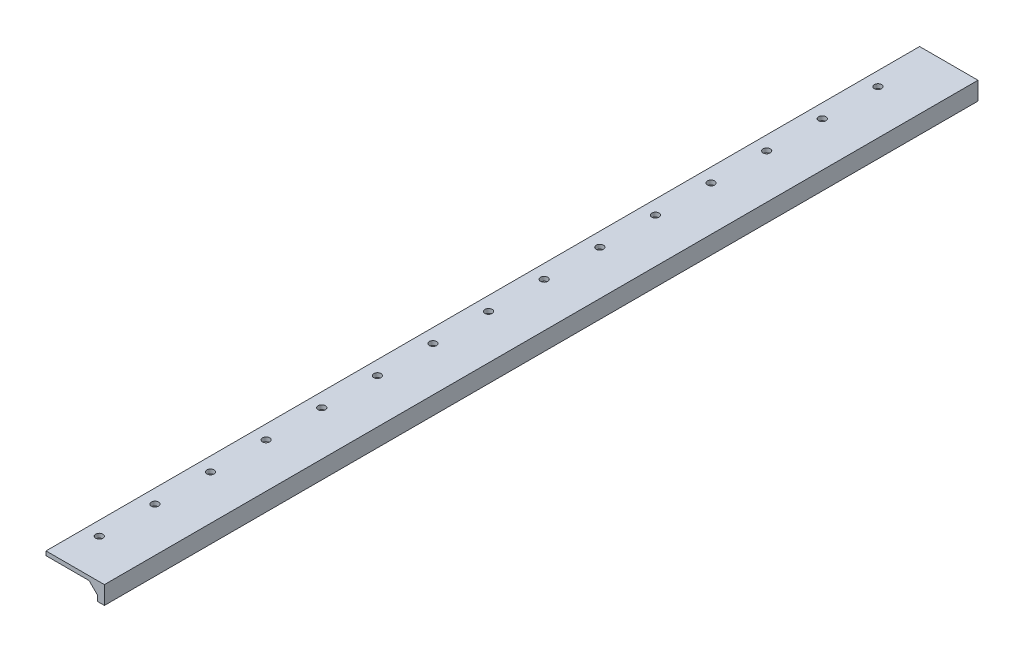
ISO-10303-21;
HEADER;
FILE_DESCRIPTION(('STEP AP214'),'2;1');
FILE_NAME('part.step','',(''),(''),'','','');
FILE_SCHEMA(('AUTOMOTIVE_DESIGN { 1 0 10303 214 1 1 1 1 }'));
ENDSEC;
DATA;
#1=APPLICATION_CONTEXT('core data for automotive mechanical design processes');
#2=APPLICATION_PROTOCOL_DEFINITION('international standard','automotive_design',2000,#1);
#3=PRODUCT_CONTEXT('',#1,'mechanical');
#4=PRODUCT('Part','Part','',(#3));
#5=PRODUCT_RELATED_PRODUCT_CATEGORY('part','',(#4));
#6=PRODUCT_DEFINITION_FORMATION('','',#4);
#7=PRODUCT_DEFINITION_CONTEXT('part definition',#1,'design');
#8=PRODUCT_DEFINITION('design','',#6,#7);
#9=PRODUCT_DEFINITION_SHAPE('','',#8);
#10=(LENGTH_UNIT() NAMED_UNIT(*) SI_UNIT(.MILLI.,.METRE.));
#11=(NAMED_UNIT(*) PLANE_ANGLE_UNIT() SI_UNIT($,.RADIAN.));
#12=(NAMED_UNIT(*) SI_UNIT($,.STERADIAN.) SOLID_ANGLE_UNIT());
#13=UNCERTAINTY_MEASURE_WITH_UNIT(LENGTH_MEASURE(1.E-05),#10,'distance_accuracy_value','');
#14=(GEOMETRIC_REPRESENTATION_CONTEXT(3) GLOBAL_UNCERTAINTY_ASSIGNED_CONTEXT((#13)) GLOBAL_UNIT_ASSIGNED_CONTEXT((#10,
#11,#12)) REPRESENTATION_CONTEXT('',''));
#15=CARTESIAN_POINT('',(0.,0.,0.));
#16=DIRECTION('',(0.,0.,1.));
#17=DIRECTION('',(1.,0.,0.));
#18=AXIS2_PLACEMENT_3D('',#15,#16,#17);
#19=CARTESIAN_POINT('',(-37.,3.,0.));
#20=DIRECTION('',(1.,0.,0.));
#21=DIRECTION('',(0.,0.,-1.));
#22=AXIS2_PLACEMENT_3D('',#19,#20,#21);
#23=PLANE('',#22);
#24=DIRECTION('',(0.,0.,1.));
#25=VECTOR('',#24,1.);
#26=CARTESIAN_POINT('',(-37.,0.,0.));
#27=LINE('',#26,#25);
#28=CARTESIAN_POINT('',(-37.,0.,0.));
#29=VERTEX_POINT('',#28);
#30=CARTESIAN_POINT('',(-36.9999999999999,0.,628.32));
#31=VERTEX_POINT('',#30);
#32=EDGE_CURVE('E73',#29,#31,#27,.T.);
#33=ORIENTED_EDGE('',*,*,#32,.T.);
#34=DIRECTION('',(0.,-1.,0.));
#35=VECTOR('',#34,1.);
#36=CARTESIAN_POINT('',(-36.9999999999999,3.,628.32));
#37=LINE('',#36,#35);
#38=CARTESIAN_POINT('',(-36.9999999999999,3.,628.32));
#39=VERTEX_POINT('',#38);
#40=EDGE_CURVE('E11',#39,#31,#37,.T.);
#41=ORIENTED_EDGE('',*,*,#40,.F.);
#42=DIRECTION('',(0.,0.,1.));
#43=VECTOR('',#42,1.);
#44=CARTESIAN_POINT('',(-37.,3.,0.));
#45=LINE('',#44,#43);
#46=CARTESIAN_POINT('',(-37.,3.,0.));
#47=VERTEX_POINT('',#46);
#48=EDGE_CURVE('E75',#47,#39,#45,.T.);
#49=ORIENTED_EDGE('',*,*,#48,.F.);
#50=DIRECTION('',(0.,-1.,0.));
#51=VECTOR('',#50,1.);
#52=CARTESIAN_POINT('',(-37.,3.,0.));
#53=LINE('',#52,#51);
#54=EDGE_CURVE('E44',#47,#29,#53,.T.);
#55=ORIENTED_EDGE('',*,*,#54,.T.);
#56=EDGE_LOOP('',(#33,#41,#49,#55));
#57=FACE_BOUND('',#56,.T.);
#58=ADVANCED_FACE('F37',(#57),#23,.F.);
#59=CARTESIAN_POINT('',(-36.9999999999999,3.,628.32));
#60=DIRECTION('',(0.,0.,-1.));
#61=DIRECTION('',(-1.,0.,0.));
#62=AXIS2_PLACEMENT_3D('',#59,#60,#61);
#63=PLANE('',#62);
#64=DIRECTION('',(1.,0.,0.));
#65=VECTOR('',#64,1.);
#66=CARTESIAN_POINT('',(-36.9999999999999,0.,628.32));
#67=LINE('',#66,#65);
#68=CARTESIAN_POINT('',(-6.,0.,628.32));
#69=VERTEX_POINT('',#68);
#70=EDGE_CURVE('E84',#31,#69,#67,.T.);
#71=ORIENTED_EDGE('',*,*,#70,.T.);
#72=DIRECTION('',(0.707106781186552,-0.707106781186543,0.));
#73=VECTOR('',#72,1.);
#74=CARTESIAN_POINT('',(0.,-6.,628.32));
#75=LINE('',#74,#73);
#76=CARTESIAN_POINT('',(0.,-6.,628.32));
#77=VERTEX_POINT('',#76);
#78=EDGE_CURVE('E51',#69,#77,#75,.T.);
#79=ORIENTED_EDGE('',*,*,#78,.T.);
#80=DIRECTION('',(0.,-1.,0.));
#81=VECTOR('',#80,1.);
#82=CARTESIAN_POINT('',(0.,3.,628.32));
#83=LINE('',#82,#81);
#84=CARTESIAN_POINT('',(0.,-10.,628.32));
#85=VERTEX_POINT('',#84);
#86=EDGE_CURVE('E85',#77,#85,#83,.T.);
#87=ORIENTED_EDGE('',*,*,#86,.T.);
#88=DIRECTION('',(-1.,0.,0.));
#89=VECTOR('',#88,1.);
#90=CARTESIAN_POINT('',(0.,-10.,628.32));
#91=LINE('',#90,#89);
#92=CARTESIAN_POINT('',(5.,-10.,628.32));
#93=VERTEX_POINT('',#92);
#94=EDGE_CURVE('E113',#93,#85,#91,.T.);
#95=ORIENTED_EDGE('',*,*,#94,.F.);
#96=DIRECTION('',(0.,-1.,0.));
#97=VECTOR('',#96,1.);
#98=CARTESIAN_POINT('',(5.,3.,628.32));
#99=LINE('',#98,#97);
#100=CARTESIAN_POINT('',(5.,3.,628.32));
#101=VERTEX_POINT('',#100);
#102=EDGE_CURVE('E107',#101,#93,#99,.T.);
#103=ORIENTED_EDGE('',*,*,#102,.F.);
#104=DIRECTION('',(1.,0.,0.));
#105=VECTOR('',#104,1.);
#106=CARTESIAN_POINT('',(-36.9999999999999,3.,628.32));
#107=LINE('',#106,#105);
#108=EDGE_CURVE('E93',#39,#101,#107,.T.);
#109=ORIENTED_EDGE('',*,*,#108,.F.);
#110=ORIENTED_EDGE('',*,*,#40,.T.);
#111=EDGE_LOOP('',(#71,#79,#87,#95,#103,#109,#110));
#112=FACE_BOUND('',#111,.T.);
#113=ADVANCED_FACE('F250',(#112),#63,.F.);
#114=CARTESIAN_POINT('',(-37.,3.,0.));
#115=DIRECTION('',(0.,0.,-1.));
#116=DIRECTION('',(-1.,0.,0.));
#117=AXIS2_PLACEMENT_3D('',#114,#115,#116);
#118=PLANE('',#117);
#119=DIRECTION('',(0.707106781186552,-0.707106781186543,0.));
#120=VECTOR('',#119,1.);
#121=CARTESIAN_POINT('',(0.,-6.,0.));
#122=LINE('',#121,#120);
#123=CARTESIAN_POINT('',(-6.,0.,0.));
#124=VERTEX_POINT('',#123);
#125=CARTESIAN_POINT('',(0.,-6.,0.));
#126=VERTEX_POINT('',#125);
#127=EDGE_CURVE('E91',#124,#126,#122,.T.);
#128=ORIENTED_EDGE('',*,*,#127,.F.);
#129=DIRECTION('',(1.,0.,0.));
#130=VECTOR('',#129,1.);
#131=CARTESIAN_POINT('',(-37.,0.,0.));
#132=LINE('',#131,#130);
#133=EDGE_CURVE('E83',#29,#124,#132,.T.);
#134=ORIENTED_EDGE('',*,*,#133,.F.);
#135=ORIENTED_EDGE('',*,*,#54,.F.);
#136=DIRECTION('',(1.,0.,0.));
#137=VECTOR('',#136,1.);
#138=CARTESIAN_POINT('',(-37.,3.,0.));
#139=LINE('',#138,#137);
#140=CARTESIAN_POINT('',(5.,3.,0.));
#141=VERTEX_POINT('',#140);
#142=EDGE_CURVE('E77',#47,#141,#139,.T.);
#143=ORIENTED_EDGE('',*,*,#142,.T.);
#144=DIRECTION('',(0.,-1.,0.));
#145=VECTOR('',#144,1.);
#146=CARTESIAN_POINT('',(5.,3.,0.));
#147=LINE('',#146,#145);
#148=CARTESIAN_POINT('',(5.,-10.,0.));
#149=VERTEX_POINT('',#148);
#150=EDGE_CURVE('E103',#141,#149,#147,.T.);
#151=ORIENTED_EDGE('',*,*,#150,.T.);
#152=DIRECTION('',(1.,0.,0.));
#153=VECTOR('',#152,1.);
#154=CARTESIAN_POINT('',(0.,-10.,0.));
#155=LINE('',#154,#153);
#156=CARTESIAN_POINT('',(0.,-10.,0.));
#157=VERTEX_POINT('',#156);
#158=EDGE_CURVE('E119',#157,#149,#155,.T.);
#159=ORIENTED_EDGE('',*,*,#158,.F.);
#160=DIRECTION('',(0.,-1.,0.));
#161=VECTOR('',#160,1.);
#162=CARTESIAN_POINT('',(0.,3.,0.));
#163=LINE('',#162,#161);
#164=EDGE_CURVE('E100',#126,#157,#163,.T.);
#165=ORIENTED_EDGE('',*,*,#164,.F.);
#166=EDGE_LOOP('',(#128,#134,#135,#143,#151,#159,#165));
#167=FACE_BOUND('',#166,.T.);
#168=ADVANCED_FACE('F88',(#167),#118,.T.);
#169=CARTESIAN_POINT('',(0.,3.,0.));
#170=DIRECTION('',(0.,1.,0.));
#171=DIRECTION('',(0.,0.,1.));
#172=AXIS2_PLACEMENT_3D('',#169,#170,#171);
#173=PLANE('',#172);
#174=CARTESIAN_POINT('',(-27.,3.,40.));
#175=DIRECTION('',(0.,1.,0.));
#176=DIRECTION('',(0.,0.,1.));
#177=AXIS2_PLACEMENT_3D('',#174,#175,#176);
#178=CIRCLE('',#177,2.6);
#179=CARTESIAN_POINT('',(-27.,3.,42.6));
#180=VERTEX_POINT('',#179);
#181=EDGE_CURVE('E125',#180,#180,#178,.T.);
#182=ORIENTED_EDGE('',*,*,#181,.F.);
#183=EDGE_LOOP('',(#182));
#184=FACE_BOUND('',#183,.T.);
#185=CARTESIAN_POINT('',(-27.0000000000001,3.,80.));
#186=DIRECTION('',(0.,1.,0.));
#187=DIRECTION('',(0.,0.,1.));
#188=AXIS2_PLACEMENT_3D('',#185,#186,#187);
#189=CIRCLE('',#188,2.6);
#190=CARTESIAN_POINT('',(-27.0000000000001,3.,82.6));
#191=VERTEX_POINT('',#190);
#192=EDGE_CURVE('E128',#191,#191,#189,.T.);
#193=ORIENTED_EDGE('',*,*,#192,.F.);
#194=EDGE_LOOP('',(#193));
#195=FACE_BOUND('',#194,.T.);
#196=CARTESIAN_POINT('',(-27.0000000000003,3.,120.));
#197=DIRECTION('',(0.,1.,0.));
#198=DIRECTION('',(0.,0.,1.));
#199=AXIS2_PLACEMENT_3D('',#196,#197,#198);
#200=CIRCLE('',#199,2.6);
#201=CARTESIAN_POINT('',(-27.0000000000003,3.,122.6));
#202=VERTEX_POINT('',#201);
#203=EDGE_CURVE('E131',#202,#202,#200,.T.);
#204=ORIENTED_EDGE('',*,*,#203,.F.);
#205=EDGE_LOOP('',(#204));
#206=FACE_BOUND('',#205,.T.);
#207=CARTESIAN_POINT('',(-27.0000000000004,3.,160.));
#208=DIRECTION('',(0.,1.,0.));
#209=DIRECTION('',(0.,0.,1.));
#210=AXIS2_PLACEMENT_3D('',#207,#208,#209);
#211=CIRCLE('',#210,2.6);
#212=CARTESIAN_POINT('',(-27.0000000000004,3.,162.6));
#213=VERTEX_POINT('',#212);
#214=EDGE_CURVE('E134',#213,#213,#211,.T.);
#215=ORIENTED_EDGE('',*,*,#214,.F.);
#216=EDGE_LOOP('',(#215));
#217=FACE_BOUND('',#216,.T.);
#218=CARTESIAN_POINT('',(-27.0000000000006,3.,200.));
#219=DIRECTION('',(0.,1.,0.));
#220=DIRECTION('',(0.,0.,1.));
#221=AXIS2_PLACEMENT_3D('',#218,#219,#220);
#222=CIRCLE('',#221,2.6);
#223=CARTESIAN_POINT('',(-27.0000000000006,3.,202.6));
#224=VERTEX_POINT('',#223);
#225=EDGE_CURVE('E137',#224,#224,#222,.T.);
#226=ORIENTED_EDGE('',*,*,#225,.F.);
#227=EDGE_LOOP('',(#226));
#228=FACE_BOUND('',#227,.T.);
#229=CARTESIAN_POINT('',(-27.0000000000007,3.,240.));
#230=DIRECTION('',(0.,1.,0.));
#231=DIRECTION('',(0.,0.,1.));
#232=AXIS2_PLACEMENT_3D('',#229,#230,#231);
#233=CIRCLE('',#232,2.6);
#234=CARTESIAN_POINT('',(-27.0000000000007,3.,242.6));
#235=VERTEX_POINT('',#234);
#236=EDGE_CURVE('E140',#235,#235,#233,.T.);
#237=ORIENTED_EDGE('',*,*,#236,.F.);
#238=EDGE_LOOP('',(#237));
#239=FACE_BOUND('',#238,.T.);
#240=CARTESIAN_POINT('',(-27.0000000000008,3.,280.));
#241=DIRECTION('',(0.,1.,0.));
#242=DIRECTION('',(0.,0.,1.));
#243=AXIS2_PLACEMENT_3D('',#240,#241,#242);
#244=CIRCLE('',#243,2.6);
#245=CARTESIAN_POINT('',(-27.0000000000008,3.,282.6));
#246=VERTEX_POINT('',#245);
#247=EDGE_CURVE('E143',#246,#246,#244,.T.);
#248=ORIENTED_EDGE('',*,*,#247,.F.);
#249=EDGE_LOOP('',(#248));
#250=FACE_BOUND('',#249,.T.);
#251=CARTESIAN_POINT('',(-27.000000000001,3.,320.));
#252=DIRECTION('',(0.,1.,0.));
#253=DIRECTION('',(0.,0.,1.));
#254=AXIS2_PLACEMENT_3D('',#251,#252,#253);
#255=CIRCLE('',#254,2.6);
#256=CARTESIAN_POINT('',(-27.000000000001,3.,322.6));
#257=VERTEX_POINT('',#256);
#258=EDGE_CURVE('E146',#257,#257,#255,.T.);
#259=ORIENTED_EDGE('',*,*,#258,.F.);
#260=EDGE_LOOP('',(#259));
#261=FACE_BOUND('',#260,.T.);
#262=CARTESIAN_POINT('',(-27.0000000000011,3.,360.));
#263=DIRECTION('',(0.,1.,0.));
#264=DIRECTION('',(0.,0.,1.));
#265=AXIS2_PLACEMENT_3D('',#262,#263,#264);
#266=CIRCLE('',#265,2.60000000000001);
#267=CARTESIAN_POINT('',(-27.0000000000011,3.,362.6));
#268=VERTEX_POINT('',#267);
#269=EDGE_CURVE('E149',#268,#268,#266,.T.);
#270=ORIENTED_EDGE('',*,*,#269,.F.);
#271=EDGE_LOOP('',(#270));
#272=FACE_BOUND('',#271,.T.);
#273=CARTESIAN_POINT('',(-27.0000000000012,3.,400.));
#274=DIRECTION('',(0.,1.,0.));
#275=DIRECTION('',(0.,0.,1.));
#276=AXIS2_PLACEMENT_3D('',#273,#274,#275);
#277=CIRCLE('',#276,2.6);
#278=CARTESIAN_POINT('',(-27.0000000000012,3.,402.6));
#279=VERTEX_POINT('',#278);
#280=EDGE_CURVE('E152',#279,#279,#277,.T.);
#281=ORIENTED_EDGE('',*,*,#280,.F.);
#282=EDGE_LOOP('',(#281));
#283=FACE_BOUND('',#282,.T.);
#284=CARTESIAN_POINT('',(-27.0000000000014,3.,440.));
#285=DIRECTION('',(0.,1.,0.));
#286=DIRECTION('',(0.,0.,1.));
#287=AXIS2_PLACEMENT_3D('',#284,#285,#286);
#288=CIRCLE('',#287,2.6);
#289=CARTESIAN_POINT('',(-27.0000000000014,3.,442.6));
#290=VERTEX_POINT('',#289);
#291=EDGE_CURVE('E155',#290,#290,#288,.T.);
#292=ORIENTED_EDGE('',*,*,#291,.F.);
#293=EDGE_LOOP('',(#292));
#294=FACE_BOUND('',#293,.T.);
#295=CARTESIAN_POINT('',(-27.0000000000015,3.,480.));
#296=DIRECTION('',(0.,1.,0.));
#297=DIRECTION('',(0.,0.,1.));
#298=AXIS2_PLACEMENT_3D('',#295,#296,#297);
#299=CIRCLE('',#298,2.60000000000001);
#300=CARTESIAN_POINT('',(-27.0000000000015,3.,482.6));
#301=VERTEX_POINT('',#300);
#302=EDGE_CURVE('E158',#301,#301,#299,.T.);
#303=ORIENTED_EDGE('',*,*,#302,.F.);
#304=EDGE_LOOP('',(#303));
#305=FACE_BOUND('',#304,.T.);
#306=CARTESIAN_POINT('',(-27.0000000000017,3.,520.));
#307=DIRECTION('',(0.,1.,0.));
#308=DIRECTION('',(0.,0.,1.));
#309=AXIS2_PLACEMENT_3D('',#306,#307,#308);
#310=CIRCLE('',#309,2.59999999999998);
#311=CARTESIAN_POINT('',(-27.0000000000017,3.,522.6));
#312=VERTEX_POINT('',#311);
#313=EDGE_CURVE('E161',#312,#312,#310,.T.);
#314=ORIENTED_EDGE('',*,*,#313,.F.);
#315=EDGE_LOOP('',(#314));
#316=FACE_BOUND('',#315,.T.);
#317=CARTESIAN_POINT('',(-27.0000000000018,3.,560.));
#318=DIRECTION('',(0.,1.,0.));
#319=DIRECTION('',(0.,0.,1.));
#320=AXIS2_PLACEMENT_3D('',#317,#318,#319);
#321=CIRCLE('',#320,2.59999999999998);
#322=CARTESIAN_POINT('',(-27.0000000000018,3.,562.6));
#323=VERTEX_POINT('',#322);
#324=EDGE_CURVE('E164',#323,#323,#321,.T.);
#325=ORIENTED_EDGE('',*,*,#324,.F.);
#326=EDGE_LOOP('',(#325));
#327=FACE_BOUND('',#326,.T.);
#328=CARTESIAN_POINT('',(-27.0000000000019,3.,600.));
#329=DIRECTION('',(0.,1.,0.));
#330=DIRECTION('',(0.,0.,1.));
#331=AXIS2_PLACEMENT_3D('',#328,#329,#330);
#332=CIRCLE('',#331,2.59999999999998);
#333=CARTESIAN_POINT('',(-27.0000000000019,3.,602.6));
#334=VERTEX_POINT('',#333);
#335=EDGE_CURVE('E167',#334,#334,#332,.T.);
#336=ORIENTED_EDGE('',*,*,#335,.F.);
#337=EDGE_LOOP('',(#336));
#338=FACE_BOUND('',#337,.T.);
#339=ORIENTED_EDGE('',*,*,#48,.T.);
#340=ORIENTED_EDGE('',*,*,#108,.T.);
#341=DIRECTION('',(0.,0.,1.));
#342=VECTOR('',#341,1.);
#343=CARTESIAN_POINT('',(5.,3.,0.));
#344=LINE('',#343,#342);
#345=EDGE_CURVE('E104',#141,#101,#344,.T.);
#346=ORIENTED_EDGE('',*,*,#345,.F.);
#347=ORIENTED_EDGE('',*,*,#142,.F.);
#348=EDGE_LOOP('',(#339,#340,#346,#347));
#349=FACE_BOUND('',#348,.T.);
#350=ADVANCED_FACE('F249',(#184,#195,#206,#217,#228,#239,#250,#261,#272,#283,#294,#305,#316,
#327,#338,#349),#173,.T.);
#351=CARTESIAN_POINT('',(0.,0.,0.));
#352=DIRECTION('',(0.,1.,0.));
#353=DIRECTION('',(0.,0.,1.));
#354=AXIS2_PLACEMENT_3D('',#351,#352,#353);
#355=PLANE('',#354);
#356=CARTESIAN_POINT('',(-27.,0.,40.));
#357=DIRECTION('',(0.,-1.,0.));
#358=DIRECTION('',(0.,0.,-1.));
#359=AXIS2_PLACEMENT_3D('',#356,#357,#358);
#360=CIRCLE('',#359,2.6);
#361=CARTESIAN_POINT('',(-27.,0.,37.4));
#362=VERTEX_POINT('',#361);
#363=EDGE_CURVE('E170',#362,#362,#360,.T.);
#364=ORIENTED_EDGE('',*,*,#363,.F.);
#365=EDGE_LOOP('',(#364));
#366=FACE_BOUND('',#365,.T.);
#367=CARTESIAN_POINT('',(-27.0000000000001,0.,80.));
#368=DIRECTION('',(0.,-1.,0.));
#369=DIRECTION('',(0.,0.,-1.));
#370=AXIS2_PLACEMENT_3D('',#367,#368,#369);
#371=CIRCLE('',#370,2.6);
#372=CARTESIAN_POINT('',(-27.0000000000001,0.,77.4));
#373=VERTEX_POINT('',#372);
#374=EDGE_CURVE('E211',#373,#373,#371,.T.);
#375=ORIENTED_EDGE('',*,*,#374,.F.);
#376=EDGE_LOOP('',(#375));
#377=FACE_BOUND('',#376,.T.);
#378=CARTESIAN_POINT('',(-27.0000000000003,0.,120.));
#379=DIRECTION('',(0.,-1.,0.));
#380=DIRECTION('',(0.,0.,-1.));
#381=AXIS2_PLACEMENT_3D('',#378,#379,#380);
#382=CIRCLE('',#381,2.6);
#383=CARTESIAN_POINT('',(-27.0000000000003,0.,117.4));
#384=VERTEX_POINT('',#383);
#385=EDGE_CURVE('E208',#384,#384,#382,.T.);
#386=ORIENTED_EDGE('',*,*,#385,.F.);
#387=EDGE_LOOP('',(#386));
#388=FACE_BOUND('',#387,.T.);
#389=CARTESIAN_POINT('',(-27.0000000000004,0.,160.));
#390=DIRECTION('',(0.,-1.,0.));
#391=DIRECTION('',(0.,0.,-1.));
#392=AXIS2_PLACEMENT_3D('',#389,#390,#391);
#393=CIRCLE('',#392,2.6);
#394=CARTESIAN_POINT('',(-27.0000000000004,0.,157.4));
#395=VERTEX_POINT('',#394);
#396=EDGE_CURVE('E205',#395,#395,#393,.T.);
#397=ORIENTED_EDGE('',*,*,#396,.F.);
#398=EDGE_LOOP('',(#397));
#399=FACE_BOUND('',#398,.T.);
#400=CARTESIAN_POINT('',(-27.0000000000006,0.,200.));
#401=DIRECTION('',(0.,-1.,0.));
#402=DIRECTION('',(0.,0.,-1.));
#403=AXIS2_PLACEMENT_3D('',#400,#401,#402);
#404=CIRCLE('',#403,2.6);
#405=CARTESIAN_POINT('',(-27.0000000000006,0.,197.4));
#406=VERTEX_POINT('',#405);
#407=EDGE_CURVE('E202',#406,#406,#404,.T.);
#408=ORIENTED_EDGE('',*,*,#407,.F.);
#409=EDGE_LOOP('',(#408));
#410=FACE_BOUND('',#409,.T.);
#411=CARTESIAN_POINT('',(-27.0000000000007,0.,240.));
#412=DIRECTION('',(0.,-1.,0.));
#413=DIRECTION('',(0.,0.,-1.));
#414=AXIS2_PLACEMENT_3D('',#411,#412,#413);
#415=CIRCLE('',#414,2.6);
#416=CARTESIAN_POINT('',(-27.0000000000007,0.,237.4));
#417=VERTEX_POINT('',#416);
#418=EDGE_CURVE('E199',#417,#417,#415,.T.);
#419=ORIENTED_EDGE('',*,*,#418,.F.);
#420=EDGE_LOOP('',(#419));
#421=FACE_BOUND('',#420,.T.);
#422=CARTESIAN_POINT('',(-27.0000000000008,0.,280.));
#423=DIRECTION('',(0.,-1.,0.));
#424=DIRECTION('',(0.,0.,-1.));
#425=AXIS2_PLACEMENT_3D('',#422,#423,#424);
#426=CIRCLE('',#425,2.6);
#427=CARTESIAN_POINT('',(-27.0000000000008,0.,277.4));
#428=VERTEX_POINT('',#427);
#429=EDGE_CURVE('E196',#428,#428,#426,.T.);
#430=ORIENTED_EDGE('',*,*,#429,.F.);
#431=EDGE_LOOP('',(#430));
#432=FACE_BOUND('',#431,.T.);
#433=CARTESIAN_POINT('',(-27.000000000001,0.,320.));
#434=DIRECTION('',(0.,-1.,0.));
#435=DIRECTION('',(0.,0.,-1.));
#436=AXIS2_PLACEMENT_3D('',#433,#434,#435);
#437=CIRCLE('',#436,2.6);
#438=CARTESIAN_POINT('',(-27.000000000001,0.,317.4));
#439=VERTEX_POINT('',#438);
#440=EDGE_CURVE('E193',#439,#439,#437,.T.);
#441=ORIENTED_EDGE('',*,*,#440,.F.);
#442=EDGE_LOOP('',(#441));
#443=FACE_BOUND('',#442,.T.);
#444=CARTESIAN_POINT('',(-27.0000000000011,0.,360.));
#445=DIRECTION('',(0.,-1.,0.));
#446=DIRECTION('',(0.,0.,-1.));
#447=AXIS2_PLACEMENT_3D('',#444,#445,#446);
#448=CIRCLE('',#447,2.60000000000001);
#449=CARTESIAN_POINT('',(-27.0000000000011,0.,357.4));
#450=VERTEX_POINT('',#449);
#451=EDGE_CURVE('E190',#450,#450,#448,.T.);
#452=ORIENTED_EDGE('',*,*,#451,.F.);
#453=EDGE_LOOP('',(#452));
#454=FACE_BOUND('',#453,.T.);
#455=CARTESIAN_POINT('',(-27.0000000000012,0.,400.));
#456=DIRECTION('',(0.,-1.,0.));
#457=DIRECTION('',(0.,0.,-1.));
#458=AXIS2_PLACEMENT_3D('',#455,#456,#457);
#459=CIRCLE('',#458,2.6);
#460=CARTESIAN_POINT('',(-27.0000000000012,0.,397.4));
#461=VERTEX_POINT('',#460);
#462=EDGE_CURVE('E187',#461,#461,#459,.T.);
#463=ORIENTED_EDGE('',*,*,#462,.F.);
#464=EDGE_LOOP('',(#463));
#465=FACE_BOUND('',#464,.T.);
#466=CARTESIAN_POINT('',(-27.0000000000014,0.,440.));
#467=DIRECTION('',(0.,-1.,0.));
#468=DIRECTION('',(0.,0.,-1.));
#469=AXIS2_PLACEMENT_3D('',#466,#467,#468);
#470=CIRCLE('',#469,2.6);
#471=CARTESIAN_POINT('',(-27.0000000000014,0.,437.4));
#472=VERTEX_POINT('',#471);
#473=EDGE_CURVE('E184',#472,#472,#470,.T.);
#474=ORIENTED_EDGE('',*,*,#473,.F.);
#475=EDGE_LOOP('',(#474));
#476=FACE_BOUND('',#475,.T.);
#477=CARTESIAN_POINT('',(-27.0000000000015,0.,480.));
#478=DIRECTION('',(0.,-1.,0.));
#479=DIRECTION('',(0.,0.,-1.));
#480=AXIS2_PLACEMENT_3D('',#477,#478,#479);
#481=CIRCLE('',#480,2.60000000000001);
#482=CARTESIAN_POINT('',(-27.0000000000015,0.,477.4));
#483=VERTEX_POINT('',#482);
#484=EDGE_CURVE('E181',#483,#483,#481,.T.);
#485=ORIENTED_EDGE('',*,*,#484,.F.);
#486=EDGE_LOOP('',(#485));
#487=FACE_BOUND('',#486,.T.);
#488=CARTESIAN_POINT('',(-27.0000000000017,0.,520.));
#489=DIRECTION('',(0.,-1.,0.));
#490=DIRECTION('',(0.,0.,-1.));
#491=AXIS2_PLACEMENT_3D('',#488,#489,#490);
#492=CIRCLE('',#491,2.59999999999998);
#493=CARTESIAN_POINT('',(-27.0000000000017,0.,517.4));
#494=VERTEX_POINT('',#493);
#495=EDGE_CURVE('E178',#494,#494,#492,.T.);
#496=ORIENTED_EDGE('',*,*,#495,.F.);
#497=EDGE_LOOP('',(#496));
#498=FACE_BOUND('',#497,.T.);
#499=CARTESIAN_POINT('',(-27.0000000000018,0.,560.));
#500=DIRECTION('',(0.,-1.,0.));
#501=DIRECTION('',(0.,0.,-1.));
#502=AXIS2_PLACEMENT_3D('',#499,#500,#501);
#503=CIRCLE('',#502,2.59999999999998);
#504=CARTESIAN_POINT('',(-27.0000000000018,0.,557.4));
#505=VERTEX_POINT('',#504);
#506=EDGE_CURVE('E174',#505,#505,#503,.T.);
#507=ORIENTED_EDGE('',*,*,#506,.F.);
#508=EDGE_LOOP('',(#507));
#509=FACE_BOUND('',#508,.T.);
#510=CARTESIAN_POINT('',(-27.0000000000019,0.,600.));
#511=DIRECTION('',(0.,-1.,0.));
#512=DIRECTION('',(0.,0.,-1.));
#513=AXIS2_PLACEMENT_3D('',#510,#511,#512);
#514=CIRCLE('',#513,2.59999999999998);
#515=CARTESIAN_POINT('',(-27.0000000000019,0.,597.4));
#516=VERTEX_POINT('',#515);
#517=EDGE_CURVE('E171',#516,#516,#514,.T.);
#518=ORIENTED_EDGE('',*,*,#517,.F.);
#519=EDGE_LOOP('',(#518));
#520=FACE_BOUND('',#519,.T.);
#521=ORIENTED_EDGE('',*,*,#133,.T.);
#522=DIRECTION('',(0.,0.,1.));
#523=VECTOR('',#522,1.);
#524=CARTESIAN_POINT('',(-6.,0.,0.));
#525=LINE('',#524,#523);
#526=EDGE_CURVE('E216',#124,#69,#525,.T.);
#527=ORIENTED_EDGE('',*,*,#526,.T.);
#528=ORIENTED_EDGE('',*,*,#70,.F.);
#529=ORIENTED_EDGE('',*,*,#32,.F.);
#530=EDGE_LOOP('',(#521,#527,#528,#529));
#531=FACE_BOUND('',#530,.T.);
#532=ADVANCED_FACE('F80',(#366,#377,#388,#399,#410,#421,#432,#443,#454,#465,#476,#487,#498,#509,
#520,#531),#355,.F.);
#533=CARTESIAN_POINT('',(0.,3.,0.));
#534=DIRECTION('',(-1.,0.,0.));
#535=DIRECTION('',(0.,0.,1.));
#536=AXIS2_PLACEMENT_3D('',#533,#534,#535);
#537=PLANE('',#536);
#538=DIRECTION('',(0.,0.,1.));
#539=VECTOR('',#538,1.);
#540=CARTESIAN_POINT('',(0.,-6.,0.));
#541=LINE('',#540,#539);
#542=EDGE_CURVE('E175',#126,#77,#541,.T.);
#543=ORIENTED_EDGE('',*,*,#542,.F.);
#544=ORIENTED_EDGE('',*,*,#164,.T.);
#545=DIRECTION('',(0.,0.,-1.));
#546=VECTOR('',#545,1.);
#547=CARTESIAN_POINT('',(0.,-10.,0.));
#548=LINE('',#547,#546);
#549=EDGE_CURVE('E122',#85,#157,#548,.T.);
#550=ORIENTED_EDGE('',*,*,#549,.F.);
#551=ORIENTED_EDGE('',*,*,#86,.F.);
#552=EDGE_LOOP('',(#543,#544,#550,#551));
#553=FACE_BOUND('',#552,.T.);
#554=ADVANCED_FACE('F229',(#553),#537,.T.);
#555=CARTESIAN_POINT('',(5.,3.,0.));
#556=DIRECTION('',(1.,0.,0.));
#557=DIRECTION('',(0.,0.,-1.));
#558=AXIS2_PLACEMENT_3D('',#555,#556,#557);
#559=PLANE('',#558);
#560=ORIENTED_EDGE('',*,*,#102,.T.);
#561=DIRECTION('',(0.,0.,1.));
#562=VECTOR('',#561,1.);
#563=CARTESIAN_POINT('',(5.,-10.,0.));
#564=LINE('',#563,#562);
#565=EDGE_CURVE('E116',#149,#93,#564,.T.);
#566=ORIENTED_EDGE('',*,*,#565,.F.);
#567=ORIENTED_EDGE('',*,*,#150,.F.);
#568=ORIENTED_EDGE('',*,*,#345,.T.);
#569=EDGE_LOOP('',(#560,#566,#567,#568));
#570=FACE_BOUND('',#569,.T.);
#571=ADVANCED_FACE('F252',(#570),#559,.T.);
#572=CARTESIAN_POINT('',(0.,-10.,0.));
#573=DIRECTION('',(0.,1.,0.));
#574=DIRECTION('',(0.,0.,1.));
#575=AXIS2_PLACEMENT_3D('',#572,#573,#574);
#576=PLANE('',#575);
#577=ORIENTED_EDGE('',*,*,#549,.T.);
#578=ORIENTED_EDGE('',*,*,#158,.T.);
#579=ORIENTED_EDGE('',*,*,#565,.T.);
#580=ORIENTED_EDGE('',*,*,#94,.T.);
#581=EDGE_LOOP('',(#577,#578,#579,#580));
#582=FACE_BOUND('',#581,.T.);
#583=ADVANCED_FACE('F237',(#582),#576,.F.);
#584=CARTESIAN_POINT('',(-27.0000000000019,10.,600.));
#585=DIRECTION('',(0.,-1.,0.));
#586=DIRECTION('',(0.,0.,-1.));
#587=AXIS2_PLACEMENT_3D('',#584,#585,#586);
#588=CYLINDRICAL_SURFACE('',#587,2.59999999999998);
#589=ORIENTED_EDGE('',*,*,#335,.T.);
#590=EDGE_LOOP('',(#589));
#591=FACE_BOUND('',#590,.T.);
#592=ORIENTED_EDGE('',*,*,#517,.T.);
#593=EDGE_LOOP('',(#592));
#594=FACE_BOUND('',#593,.T.);
#595=ADVANCED_FACE('F262',(#591,#594),#588,.F.);
#596=CARTESIAN_POINT('',(-27.0000000000018,10.,560.));
#597=DIRECTION('',(0.,-1.,0.));
#598=DIRECTION('',(0.,0.,-1.));
#599=AXIS2_PLACEMENT_3D('',#596,#597,#598);
#600=CYLINDRICAL_SURFACE('',#599,2.59999999999998);
#601=ORIENTED_EDGE('',*,*,#324,.T.);
#602=EDGE_LOOP('',(#601));
#603=FACE_BOUND('',#602,.T.);
#604=ORIENTED_EDGE('',*,*,#506,.T.);
#605=EDGE_LOOP('',(#604));
#606=FACE_BOUND('',#605,.T.);
#607=ADVANCED_FACE('F316',(#603,#606),#600,.F.);
#608=CARTESIAN_POINT('',(-27.0000000000017,10.,520.));
#609=DIRECTION('',(0.,-1.,0.));
#610=DIRECTION('',(0.,0.,-1.));
#611=AXIS2_PLACEMENT_3D('',#608,#609,#610);
#612=CYLINDRICAL_SURFACE('',#611,2.59999999999998);
#613=ORIENTED_EDGE('',*,*,#313,.T.);
#614=EDGE_LOOP('',(#613));
#615=FACE_BOUND('',#614,.T.);
#616=ORIENTED_EDGE('',*,*,#495,.T.);
#617=EDGE_LOOP('',(#616));
#618=FACE_BOUND('',#617,.T.);
#619=ADVANCED_FACE('F323',(#615,#618),#612,.F.);
#620=CARTESIAN_POINT('',(-27.0000000000015,10.,480.));
#621=DIRECTION('',(0.,-1.,0.));
#622=DIRECTION('',(0.,0.,-1.));
#623=AXIS2_PLACEMENT_3D('',#620,#621,#622);
#624=CYLINDRICAL_SURFACE('',#623,2.60000000000001);
#625=ORIENTED_EDGE('',*,*,#302,.T.);
#626=EDGE_LOOP('',(#625));
#627=FACE_BOUND('',#626,.T.);
#628=ORIENTED_EDGE('',*,*,#484,.T.);
#629=EDGE_LOOP('',(#628));
#630=FACE_BOUND('',#629,.T.);
#631=ADVANCED_FACE('F329',(#627,#630),#624,.F.);
#632=CARTESIAN_POINT('',(-27.0000000000014,10.,440.));
#633=DIRECTION('',(0.,-1.,0.));
#634=DIRECTION('',(0.,0.,-1.));
#635=AXIS2_PLACEMENT_3D('',#632,#633,#634);
#636=CYLINDRICAL_SURFACE('',#635,2.6);
#637=ORIENTED_EDGE('',*,*,#291,.T.);
#638=EDGE_LOOP('',(#637));
#639=FACE_BOUND('',#638,.T.);
#640=ORIENTED_EDGE('',*,*,#473,.T.);
#641=EDGE_LOOP('',(#640));
#642=FACE_BOUND('',#641,.T.);
#643=ADVANCED_FACE('F333',(#639,#642),#636,.F.);
#644=CARTESIAN_POINT('',(-27.0000000000012,10.,400.));
#645=DIRECTION('',(0.,-1.,0.));
#646=DIRECTION('',(0.,0.,-1.));
#647=AXIS2_PLACEMENT_3D('',#644,#645,#646);
#648=CYLINDRICAL_SURFACE('',#647,2.6);
#649=ORIENTED_EDGE('',*,*,#280,.T.);
#650=EDGE_LOOP('',(#649));
#651=FACE_BOUND('',#650,.T.);
#652=ORIENTED_EDGE('',*,*,#462,.T.);
#653=EDGE_LOOP('',(#652));
#654=FACE_BOUND('',#653,.T.);
#655=ADVANCED_FACE('F337',(#651,#654),#648,.F.);
#656=CARTESIAN_POINT('',(-27.0000000000011,10.,360.));
#657=DIRECTION('',(0.,-1.,0.));
#658=DIRECTION('',(0.,0.,-1.));
#659=AXIS2_PLACEMENT_3D('',#656,#657,#658);
#660=CYLINDRICAL_SURFACE('',#659,2.60000000000001);
#661=ORIENTED_EDGE('',*,*,#269,.T.);
#662=EDGE_LOOP('',(#661));
#663=FACE_BOUND('',#662,.T.);
#664=ORIENTED_EDGE('',*,*,#451,.T.);
#665=EDGE_LOOP('',(#664));
#666=FACE_BOUND('',#665,.T.);
#667=ADVANCED_FACE('F341',(#663,#666),#660,.F.);
#668=CARTESIAN_POINT('',(-27.000000000001,10.,320.));
#669=DIRECTION('',(0.,-1.,0.));
#670=DIRECTION('',(0.,0.,-1.));
#671=AXIS2_PLACEMENT_3D('',#668,#669,#670);
#672=CYLINDRICAL_SURFACE('',#671,2.6);
#673=ORIENTED_EDGE('',*,*,#258,.T.);
#674=EDGE_LOOP('',(#673));
#675=FACE_BOUND('',#674,.T.);
#676=ORIENTED_EDGE('',*,*,#440,.T.);
#677=EDGE_LOOP('',(#676));
#678=FACE_BOUND('',#677,.T.);
#679=ADVANCED_FACE('F345',(#675,#678),#672,.F.);
#680=CARTESIAN_POINT('',(-27.0000000000008,10.,280.));
#681=DIRECTION('',(0.,-1.,0.));
#682=DIRECTION('',(0.,0.,-1.));
#683=AXIS2_PLACEMENT_3D('',#680,#681,#682);
#684=CYLINDRICAL_SURFACE('',#683,2.6);
#685=ORIENTED_EDGE('',*,*,#247,.T.);
#686=EDGE_LOOP('',(#685));
#687=FACE_BOUND('',#686,.T.);
#688=ORIENTED_EDGE('',*,*,#429,.T.);
#689=EDGE_LOOP('',(#688));
#690=FACE_BOUND('',#689,.T.);
#691=ADVANCED_FACE('F349',(#687,#690),#684,.F.);
#692=CARTESIAN_POINT('',(-27.0000000000007,10.,240.));
#693=DIRECTION('',(0.,-1.,0.));
#694=DIRECTION('',(0.,0.,-1.));
#695=AXIS2_PLACEMENT_3D('',#692,#693,#694);
#696=CYLINDRICAL_SURFACE('',#695,2.6);
#697=ORIENTED_EDGE('',*,*,#236,.T.);
#698=EDGE_LOOP('',(#697));
#699=FACE_BOUND('',#698,.T.);
#700=ORIENTED_EDGE('',*,*,#418,.T.);
#701=EDGE_LOOP('',(#700));
#702=FACE_BOUND('',#701,.T.);
#703=ADVANCED_FACE('F353',(#699,#702),#696,.F.);
#704=CARTESIAN_POINT('',(-27.0000000000006,10.,200.));
#705=DIRECTION('',(0.,-1.,0.));
#706=DIRECTION('',(0.,0.,-1.));
#707=AXIS2_PLACEMENT_3D('',#704,#705,#706);
#708=CYLINDRICAL_SURFACE('',#707,2.6);
#709=ORIENTED_EDGE('',*,*,#225,.T.);
#710=EDGE_LOOP('',(#709));
#711=FACE_BOUND('',#710,.T.);
#712=ORIENTED_EDGE('',*,*,#407,.T.);
#713=EDGE_LOOP('',(#712));
#714=FACE_BOUND('',#713,.T.);
#715=ADVANCED_FACE('F357',(#711,#714),#708,.F.);
#716=CARTESIAN_POINT('',(-27.0000000000004,10.,160.));
#717=DIRECTION('',(0.,-1.,0.));
#718=DIRECTION('',(0.,0.,-1.));
#719=AXIS2_PLACEMENT_3D('',#716,#717,#718);
#720=CYLINDRICAL_SURFACE('',#719,2.6);
#721=ORIENTED_EDGE('',*,*,#214,.T.);
#722=EDGE_LOOP('',(#721));
#723=FACE_BOUND('',#722,.T.);
#724=ORIENTED_EDGE('',*,*,#396,.T.);
#725=EDGE_LOOP('',(#724));
#726=FACE_BOUND('',#725,.T.);
#727=ADVANCED_FACE('F361',(#723,#726),#720,.F.);
#728=CARTESIAN_POINT('',(-27.0000000000003,10.,120.));
#729=DIRECTION('',(0.,-1.,0.));
#730=DIRECTION('',(0.,0.,-1.));
#731=AXIS2_PLACEMENT_3D('',#728,#729,#730);
#732=CYLINDRICAL_SURFACE('',#731,2.6);
#733=ORIENTED_EDGE('',*,*,#203,.T.);
#734=EDGE_LOOP('',(#733));
#735=FACE_BOUND('',#734,.T.);
#736=ORIENTED_EDGE('',*,*,#385,.T.);
#737=EDGE_LOOP('',(#736));
#738=FACE_BOUND('',#737,.T.);
#739=ADVANCED_FACE('F365',(#735,#738),#732,.F.);
#740=CARTESIAN_POINT('',(-27.0000000000001,10.,80.));
#741=DIRECTION('',(0.,-1.,0.));
#742=DIRECTION('',(0.,0.,-1.));
#743=AXIS2_PLACEMENT_3D('',#740,#741,#742);
#744=CYLINDRICAL_SURFACE('',#743,2.6);
#745=ORIENTED_EDGE('',*,*,#192,.T.);
#746=EDGE_LOOP('',(#745));
#747=FACE_BOUND('',#746,.T.);
#748=ORIENTED_EDGE('',*,*,#374,.T.);
#749=EDGE_LOOP('',(#748));
#750=FACE_BOUND('',#749,.T.);
#751=ADVANCED_FACE('F369',(#747,#750),#744,.F.);
#752=CARTESIAN_POINT('',(-27.,10.,40.));
#753=DIRECTION('',(0.,-1.,0.));
#754=DIRECTION('',(0.,0.,-1.));
#755=AXIS2_PLACEMENT_3D('',#752,#753,#754);
#756=CYLINDRICAL_SURFACE('',#755,2.6);
#757=ORIENTED_EDGE('',*,*,#181,.T.);
#758=EDGE_LOOP('',(#757));
#759=FACE_BOUND('',#758,.T.);
#760=ORIENTED_EDGE('',*,*,#363,.T.);
#761=EDGE_LOOP('',(#760));
#762=FACE_BOUND('',#761,.T.);
#763=ADVANCED_FACE('F373',(#759,#762),#756,.F.);
#764=CARTESIAN_POINT('',(0.,-6.,0.));
#765=DIRECTION('',(-0.707106781186543,-0.707106781186552,0.));
#766=DIRECTION('',(0.707106781186552,-0.707106781186543,0.));
#767=AXIS2_PLACEMENT_3D('',#764,#765,#766);
#768=PLANE('',#767);
#769=ORIENTED_EDGE('',*,*,#78,.F.);
#770=ORIENTED_EDGE('',*,*,#526,.F.);
#771=ORIENTED_EDGE('',*,*,#127,.T.);
#772=ORIENTED_EDGE('',*,*,#542,.T.);
#773=EDGE_LOOP('',(#769,#770,#771,#772));
#774=FACE_BOUND('',#773,.T.);
#775=ADVANCED_FACE('F224',(#774),#768,.T.);
#776=CLOSED_SHELL('',(#58,#113,#168,#350,#532,#554,#571,#583,#595,#607,#619,#631,#643,#655,#667,
#679,#691,#703,#715,#727,#739,#751,#763,#775));
#777=MANIFOLD_SOLID_BREP('B2',#776);
#778=ADVANCED_BREP_SHAPE_REPRESENTATION('',(#18,#777),#14);
#779=SHAPE_DEFINITION_REPRESENTATION(#9,#778);
ENDSEC;
END-ISO-10303-21;
